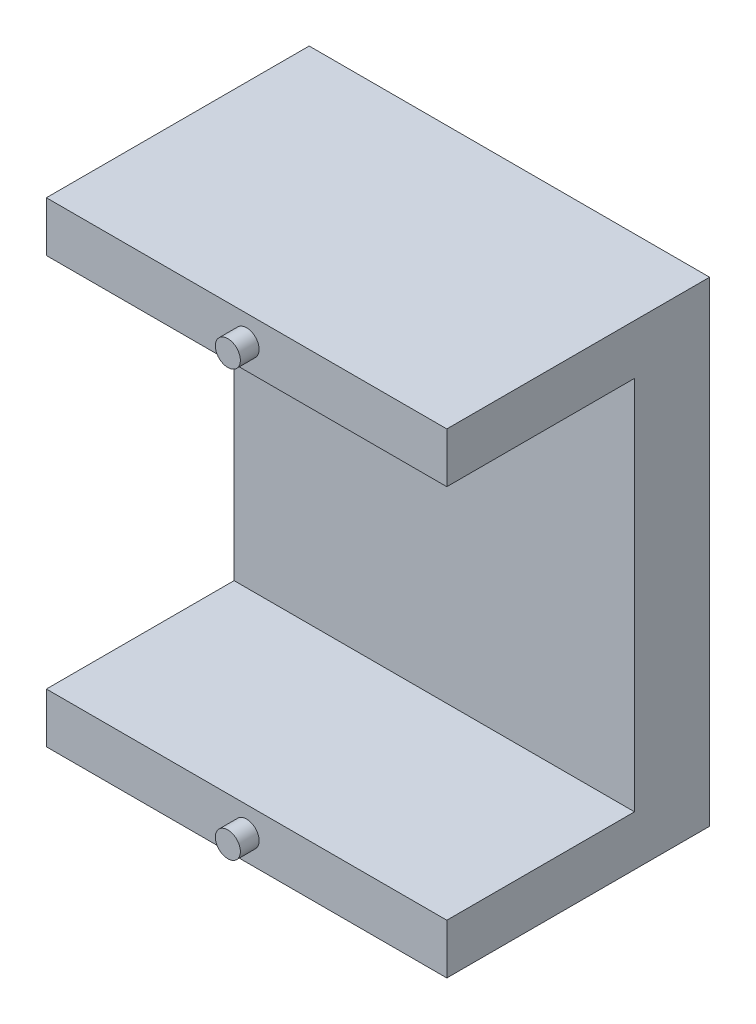
ISO-10303-21;
HEADER;
FILE_DESCRIPTION(('STEP AP214'),'2;1');
FILE_NAME('part.step','',(''),(''),'','','');
FILE_SCHEMA(('AUTOMOTIVE_DESIGN { 1 0 10303 214 1 1 1 1 }'));
ENDSEC;
DATA;
#1=APPLICATION_CONTEXT('core data for automotive mechanical design processes');
#2=APPLICATION_PROTOCOL_DEFINITION('international standard','automotive_design',2000,#1);
#3=PRODUCT_CONTEXT('',#1,'mechanical');
#4=PRODUCT('Part','Part','',(#3));
#5=PRODUCT_RELATED_PRODUCT_CATEGORY('part','',(#4));
#6=PRODUCT_DEFINITION_FORMATION('','',#4);
#7=PRODUCT_DEFINITION_CONTEXT('part definition',#1,'design');
#8=PRODUCT_DEFINITION('design','',#6,#7);
#9=PRODUCT_DEFINITION_SHAPE('','',#8);
#10=(LENGTH_UNIT() NAMED_UNIT(*) SI_UNIT(.MILLI.,.METRE.));
#11=(NAMED_UNIT(*) PLANE_ANGLE_UNIT() SI_UNIT($,.RADIAN.));
#12=(NAMED_UNIT(*) SI_UNIT($,.STERADIAN.) SOLID_ANGLE_UNIT());
#13=UNCERTAINTY_MEASURE_WITH_UNIT(LENGTH_MEASURE(1.E-05),#10,'distance_accuracy_value','');
#14=(GEOMETRIC_REPRESENTATION_CONTEXT(3) GLOBAL_UNCERTAINTY_ASSIGNED_CONTEXT((#13)) GLOBAL_UNIT_ASSIGNED_CONTEXT((#10,
#11,#12)) REPRESENTATION_CONTEXT('',''));
#15=CARTESIAN_POINT('',(0.,0.,0.));
#16=DIRECTION('',(0.,0.,1.));
#17=DIRECTION('',(1.,0.,0.));
#18=AXIS2_PLACEMENT_3D('',#15,#16,#17);
#19=CARTESIAN_POINT('',(16.,0.,0.));
#20=DIRECTION('',(0.,0.,1.));
#21=DIRECTION('',(1.,0.,0.));
#22=AXIS2_PLACEMENT_3D('',#19,#20,#21);
#23=PLANE('',#22);
#24=DIRECTION('',(0.,1.,0.));
#25=VECTOR('',#24,1.);
#26=CARTESIAN_POINT('',(-16.,0.,0.));
#27=LINE('',#26,#25);
#28=CARTESIAN_POINT('',(-16.,0.,0.));
#29=VERTEX_POINT('',#28);
#30=CARTESIAN_POINT('',(-16.,4.,0.));
#31=VERTEX_POINT('',#30);
#32=EDGE_CURVE('E151',#29,#31,#27,.T.);
#33=ORIENTED_EDGE('',*,*,#32,.F.);
#34=DIRECTION('',(-1.,0.,0.));
#35=VECTOR('',#34,1.);
#36=CARTESIAN_POINT('',(16.,0.,0.));
#37=LINE('',#36,#35);
#38=CARTESIAN_POINT('',(16.,0.,0.));
#39=VERTEX_POINT('',#38);
#40=EDGE_CURVE('E43',#39,#29,#37,.T.);
#41=ORIENTED_EDGE('',*,*,#40,.F.);
#42=DIRECTION('',(0.,1.,0.));
#43=VECTOR('',#42,1.);
#44=CARTESIAN_POINT('',(16.,0.,0.));
#45=LINE('',#44,#43);
#46=CARTESIAN_POINT('',(16.,4.,0.));
#47=VERTEX_POINT('',#46);
#48=EDGE_CURVE('E122',#39,#47,#45,.T.);
#49=ORIENTED_EDGE('',*,*,#48,.T.);
#50=DIRECTION('',(-1.,0.,0.));
#51=VECTOR('',#50,1.);
#52=CARTESIAN_POINT('',(16.,4.,0.));
#53=LINE('',#52,#51);
#54=EDGE_CURVE('E11',#47,#31,#53,.T.);
#55=ORIENTED_EDGE('',*,*,#54,.T.);
#56=EDGE_LOOP('',(#33,#41,#49,#55));
#57=FACE_BOUND('',#56,.T.);
#58=CARTESIAN_POINT('',(0.,2.,0.));
#59=DIRECTION('',(0.,0.,1.));
#60=DIRECTION('',(1.,0.,0.));
#61=AXIS2_PLACEMENT_3D('',#58,#59,#60);
#62=CIRCLE('',#61,1.);
#63=CARTESIAN_POINT('',(1.,2.,0.));
#64=VERTEX_POINT('',#63);
#65=EDGE_CURVE('E37',#64,#64,#62,.F.);
#66=ORIENTED_EDGE('',*,*,#65,.T.);
#67=EDGE_LOOP('',(#66));
#68=FACE_BOUND('',#67,.T.);
#69=ADVANCED_FACE('F33',(#57,#68),#23,.T.);
#70=CARTESIAN_POINT('',(16.,34.,0.));
#71=DIRECTION('',(0.,0.,1.));
#72=DIRECTION('',(1.,0.,0.));
#73=AXIS2_PLACEMENT_3D('',#70,#71,#72);
#74=PLANE('',#73);
#75=DIRECTION('',(0.,1.,0.));
#76=VECTOR('',#75,1.);
#77=CARTESIAN_POINT('',(-16.,34.,0.));
#78=LINE('',#77,#76);
#79=CARTESIAN_POINT('',(-16.,34.,0.));
#80=VERTEX_POINT('',#79);
#81=CARTESIAN_POINT('',(-16.,38.,0.));
#82=VERTEX_POINT('',#81);
#83=EDGE_CURVE('E142',#80,#82,#78,.T.);
#84=ORIENTED_EDGE('',*,*,#83,.F.);
#85=DIRECTION('',(-1.,0.,0.));
#86=VECTOR('',#85,1.);
#87=CARTESIAN_POINT('',(16.,34.,0.));
#88=LINE('',#87,#86);
#89=CARTESIAN_POINT('',(16.,34.,0.));
#90=VERTEX_POINT('',#89);
#91=EDGE_CURVE('E159',#90,#80,#88,.T.);
#92=ORIENTED_EDGE('',*,*,#91,.F.);
#93=DIRECTION('',(0.,1.,0.));
#94=VECTOR('',#93,1.);
#95=CARTESIAN_POINT('',(16.,34.,0.));
#96=LINE('',#95,#94);
#97=CARTESIAN_POINT('',(16.,38.,0.));
#98=VERTEX_POINT('',#97);
#99=EDGE_CURVE('E127',#90,#98,#96,.T.);
#100=ORIENTED_EDGE('',*,*,#99,.T.);
#101=DIRECTION('',(-1.,0.,0.));
#102=VECTOR('',#101,1.);
#103=CARTESIAN_POINT('',(16.,38.,0.));
#104=LINE('',#103,#102);
#105=EDGE_CURVE('E157',#98,#82,#104,.T.);
#106=ORIENTED_EDGE('',*,*,#105,.T.);
#107=EDGE_LOOP('',(#84,#92,#100,#106));
#108=FACE_BOUND('',#107,.T.);
#109=CARTESIAN_POINT('',(0.,36.,0.));
#110=DIRECTION('',(0.,0.,1.));
#111=DIRECTION('',(1.,0.,0.));
#112=AXIS2_PLACEMENT_3D('',#109,#110,#111);
#113=CIRCLE('',#112,1.);
#114=CARTESIAN_POINT('',(1.,36.,0.));
#115=VERTEX_POINT('',#114);
#116=EDGE_CURVE('E136',#115,#115,#113,.F.);
#117=ORIENTED_EDGE('',*,*,#116,.T.);
#118=EDGE_LOOP('',(#117));
#119=FACE_BOUND('',#118,.T.);
#120=ADVANCED_FACE('F184',(#108,#119),#74,.T.);
#121=CARTESIAN_POINT('',(16.,4.,0.));
#122=DIRECTION('',(0.,1.,0.));
#123=DIRECTION('',(0.,0.,1.));
#124=AXIS2_PLACEMENT_3D('',#121,#122,#123);
#125=PLANE('',#124);
#126=DIRECTION('',(0.,0.,-1.));
#127=VECTOR('',#126,1.);
#128=CARTESIAN_POINT('',(-16.,4.,0.));
#129=LINE('',#128,#127);
#130=CARTESIAN_POINT('',(-16.,4.,-15.));
#131=VERTEX_POINT('',#130);
#132=EDGE_CURVE('E132',#31,#131,#129,.T.);
#133=ORIENTED_EDGE('',*,*,#132,.F.);
#134=ORIENTED_EDGE('',*,*,#54,.F.);
#135=DIRECTION('',(0.,0.,-1.));
#136=VECTOR('',#135,1.);
#137=CARTESIAN_POINT('',(16.,4.,0.));
#138=LINE('',#137,#136);
#139=CARTESIAN_POINT('',(16.,4.,-15.));
#140=VERTEX_POINT('',#139);
#141=EDGE_CURVE('E153',#47,#140,#138,.T.);
#142=ORIENTED_EDGE('',*,*,#141,.T.);
#143=DIRECTION('',(-1.,0.,0.));
#144=VECTOR('',#143,1.);
#145=CARTESIAN_POINT('',(16.,4.,-15.));
#146=LINE('',#145,#144);
#147=EDGE_CURVE('E90',#140,#131,#146,.T.);
#148=ORIENTED_EDGE('',*,*,#147,.T.);
#149=EDGE_LOOP('',(#133,#134,#142,#148));
#150=FACE_BOUND('',#149,.T.);
#151=ADVANCED_FACE('F35',(#150),#125,.T.);
#152=CARTESIAN_POINT('',(16.,0.,-21.));
#153=DIRECTION('',(0.,-1.,0.));
#154=DIRECTION('',(0.,0.,-1.));
#155=AXIS2_PLACEMENT_3D('',#152,#153,#154);
#156=PLANE('',#155);
#157=DIRECTION('',(0.,0.,1.));
#158=VECTOR('',#157,1.);
#159=CARTESIAN_POINT('',(-16.,0.,-21.));
#160=LINE('',#159,#158);
#161=CARTESIAN_POINT('',(-16.,0.,-21.));
#162=VERTEX_POINT('',#161);
#163=EDGE_CURVE('E109',#162,#29,#160,.T.);
#164=ORIENTED_EDGE('',*,*,#163,.F.);
#165=DIRECTION('',(-1.,0.,0.));
#166=VECTOR('',#165,1.);
#167=CARTESIAN_POINT('',(16.,0.,-21.));
#168=LINE('',#167,#166);
#169=CARTESIAN_POINT('',(16.,0.,-21.));
#170=VERTEX_POINT('',#169);
#171=EDGE_CURVE('E104',#170,#162,#168,.T.);
#172=ORIENTED_EDGE('',*,*,#171,.F.);
#173=DIRECTION('',(0.,0.,1.));
#174=VECTOR('',#173,1.);
#175=CARTESIAN_POINT('',(16.,0.,-21.));
#176=LINE('',#175,#174);
#177=EDGE_CURVE('E107',#170,#39,#176,.T.);
#178=ORIENTED_EDGE('',*,*,#177,.T.);
#179=ORIENTED_EDGE('',*,*,#40,.T.);
#180=EDGE_LOOP('',(#164,#172,#178,#179));
#181=FACE_BOUND('',#180,.T.);
#182=ADVANCED_FACE('F106',(#181),#156,.T.);
#183=CARTESIAN_POINT('',(16.,38.,-21.));
#184=DIRECTION('',(0.,0.,-1.));
#185=DIRECTION('',(0.,1.,0.));
#186=AXIS2_PLACEMENT_3D('',#183,#184,#185);
#187=PLANE('',#186);
#188=DIRECTION('',(0.,-1.,0.));
#189=VECTOR('',#188,1.);
#190=CARTESIAN_POINT('',(-16.,38.,-21.));
#191=LINE('',#190,#189);
#192=CARTESIAN_POINT('',(-16.,38.,-21.));
#193=VERTEX_POINT('',#192);
#194=EDGE_CURVE('E148',#193,#162,#191,.T.);
#195=ORIENTED_EDGE('',*,*,#194,.F.);
#196=DIRECTION('',(-1.,0.,0.));
#197=VECTOR('',#196,1.);
#198=CARTESIAN_POINT('',(16.,38.,-21.));
#199=LINE('',#198,#197);
#200=CARTESIAN_POINT('',(16.,38.,-21.));
#201=VERTEX_POINT('',#200);
#202=EDGE_CURVE('E114',#201,#193,#199,.T.);
#203=ORIENTED_EDGE('',*,*,#202,.F.);
#204=DIRECTION('',(0.,-1.,0.));
#205=VECTOR('',#204,1.);
#206=CARTESIAN_POINT('',(16.,38.,-21.));
#207=LINE('',#206,#205);
#208=EDGE_CURVE('E120',#201,#170,#207,.T.);
#209=ORIENTED_EDGE('',*,*,#208,.T.);
#210=ORIENTED_EDGE('',*,*,#171,.T.);
#211=EDGE_LOOP('',(#195,#203,#209,#210));
#212=FACE_BOUND('',#211,.T.);
#213=ADVANCED_FACE('F124',(#212),#187,.T.);
#214=CARTESIAN_POINT('',(16.,38.,0.));
#215=DIRECTION('',(0.,1.,0.));
#216=DIRECTION('',(0.,0.,1.));
#217=AXIS2_PLACEMENT_3D('',#214,#215,#216);
#218=PLANE('',#217);
#219=DIRECTION('',(0.,0.,-1.));
#220=VECTOR('',#219,1.);
#221=CARTESIAN_POINT('',(-16.,38.,0.));
#222=LINE('',#221,#220);
#223=EDGE_CURVE('E145',#82,#193,#222,.T.);
#224=ORIENTED_EDGE('',*,*,#223,.F.);
#225=ORIENTED_EDGE('',*,*,#105,.F.);
#226=DIRECTION('',(0.,0.,-1.));
#227=VECTOR('',#226,1.);
#228=CARTESIAN_POINT('',(16.,38.,0.));
#229=LINE('',#228,#227);
#230=EDGE_CURVE('E125',#98,#201,#229,.T.);
#231=ORIENTED_EDGE('',*,*,#230,.T.);
#232=ORIENTED_EDGE('',*,*,#202,.T.);
#233=EDGE_LOOP('',(#224,#225,#231,#232));
#234=FACE_BOUND('',#233,.T.);
#235=ADVANCED_FACE('F226',(#234),#218,.T.);
#236=CARTESIAN_POINT('',(16.,34.,-15.));
#237=DIRECTION('',(0.,-1.,0.));
#238=DIRECTION('',(0.,0.,-1.));
#239=AXIS2_PLACEMENT_3D('',#236,#237,#238);
#240=PLANE('',#239);
#241=DIRECTION('',(0.,0.,1.));
#242=VECTOR('',#241,1.);
#243=CARTESIAN_POINT('',(-16.,34.,-15.));
#244=LINE('',#243,#242);
#245=CARTESIAN_POINT('',(-16.,34.,-15.));
#246=VERTEX_POINT('',#245);
#247=EDGE_CURVE('E139',#246,#80,#244,.T.);
#248=ORIENTED_EDGE('',*,*,#247,.F.);
#249=DIRECTION('',(-1.,0.,0.));
#250=VECTOR('',#249,1.);
#251=CARTESIAN_POINT('',(16.,34.,-15.));
#252=LINE('',#251,#250);
#253=CARTESIAN_POINT('',(16.,34.,-15.));
#254=VERTEX_POINT('',#253);
#255=EDGE_CURVE('E161',#254,#246,#252,.T.);
#256=ORIENTED_EDGE('',*,*,#255,.F.);
#257=DIRECTION('',(0.,0.,1.));
#258=VECTOR('',#257,1.);
#259=CARTESIAN_POINT('',(16.,34.,-15.));
#260=LINE('',#259,#258);
#261=EDGE_CURVE('E178',#254,#90,#260,.T.);
#262=ORIENTED_EDGE('',*,*,#261,.T.);
#263=ORIENTED_EDGE('',*,*,#91,.T.);
#264=EDGE_LOOP('',(#248,#256,#262,#263));
#265=FACE_BOUND('',#264,.T.);
#266=ADVANCED_FACE('F189',(#265),#240,.T.);
#267=CARTESIAN_POINT('',(16.,4.,-15.));
#268=DIRECTION('',(0.,0.,1.));
#269=DIRECTION('',(1.,0.,0.));
#270=AXIS2_PLACEMENT_3D('',#267,#268,#269);
#271=PLANE('',#270);
#272=DIRECTION('',(0.,1.,0.));
#273=VECTOR('',#272,1.);
#274=CARTESIAN_POINT('',(-16.,4.,-15.));
#275=LINE('',#274,#273);
#276=EDGE_CURVE('E135',#131,#246,#275,.T.);
#277=ORIENTED_EDGE('',*,*,#276,.F.);
#278=ORIENTED_EDGE('',*,*,#147,.F.);
#279=DIRECTION('',(0.,1.,0.));
#280=VECTOR('',#279,1.);
#281=CARTESIAN_POINT('',(16.,4.,-15.));
#282=LINE('',#281,#280);
#283=EDGE_CURVE('E176',#140,#254,#282,.T.);
#284=ORIENTED_EDGE('',*,*,#283,.T.);
#285=ORIENTED_EDGE('',*,*,#255,.T.);
#286=EDGE_LOOP('',(#277,#278,#284,#285));
#287=FACE_BOUND('',#286,.T.);
#288=ADVANCED_FACE('F190',(#287),#271,.T.);
#289=CARTESIAN_POINT('',(16.,0.,0.));
#290=DIRECTION('',(1.,0.,0.));
#291=DIRECTION('',(0.,0.,-1.));
#292=AXIS2_PLACEMENT_3D('',#289,#290,#291);
#293=PLANE('',#292);
#294=ORIENTED_EDGE('',*,*,#141,.F.);
#295=ORIENTED_EDGE('',*,*,#48,.F.);
#296=ORIENTED_EDGE('',*,*,#177,.F.);
#297=ORIENTED_EDGE('',*,*,#208,.F.);
#298=ORIENTED_EDGE('',*,*,#230,.F.);
#299=ORIENTED_EDGE('',*,*,#99,.F.);
#300=ORIENTED_EDGE('',*,*,#261,.F.);
#301=ORIENTED_EDGE('',*,*,#283,.F.);
#302=EDGE_LOOP('',(#294,#295,#296,#297,#298,#299,#300,#301));
#303=FACE_BOUND('',#302,.T.);
#304=ADVANCED_FACE('F118',(#303),#293,.T.);
#305=CARTESIAN_POINT('',(-16.,0.,0.));
#306=DIRECTION('',(1.,0.,0.));
#307=DIRECTION('',(0.,0.,-1.));
#308=AXIS2_PLACEMENT_3D('',#305,#306,#307);
#309=PLANE('',#308);
#310=ORIENTED_EDGE('',*,*,#132,.T.);
#311=ORIENTED_EDGE('',*,*,#276,.T.);
#312=ORIENTED_EDGE('',*,*,#247,.T.);
#313=ORIENTED_EDGE('',*,*,#83,.T.);
#314=ORIENTED_EDGE('',*,*,#223,.T.);
#315=ORIENTED_EDGE('',*,*,#194,.T.);
#316=ORIENTED_EDGE('',*,*,#163,.T.);
#317=ORIENTED_EDGE('',*,*,#32,.T.);
#318=EDGE_LOOP('',(#310,#311,#312,#313,#314,#315,#316,#317));
#319=FACE_BOUND('',#318,.T.);
#320=ADVANCED_FACE('F192',(#319),#309,.F.);
#321=CARTESIAN_POINT('',(0.,36.,1.5));
#322=DIRECTION('',(0.,0.,-1.));
#323=DIRECTION('',(-1.,0.,0.));
#324=AXIS2_PLACEMENT_3D('',#321,#322,#323);
#325=CYLINDRICAL_SURFACE('',#324,1.);
#326=ORIENTED_EDGE('',*,*,#116,.F.);
#327=EDGE_LOOP('',(#326));
#328=FACE_BOUND('',#327,.T.);
#329=CARTESIAN_POINT('',(0.,36.,1.5));
#330=DIRECTION('',(0.,0.,1.));
#331=DIRECTION('',(1.,0.,0.));
#332=AXIS2_PLACEMENT_3D('',#329,#330,#331);
#333=CIRCLE('',#332,1.);
#334=CARTESIAN_POINT('',(1.,36.,1.5));
#335=VERTEX_POINT('',#334);
#336=EDGE_CURVE('E164',#335,#335,#333,.T.);
#337=ORIENTED_EDGE('',*,*,#336,.F.);
#338=EDGE_LOOP('',(#337));
#339=FACE_BOUND('',#338,.T.);
#340=ADVANCED_FACE('F214',(#328,#339),#325,.T.);
#341=CARTESIAN_POINT('',(0.,36.,1.5));
#342=DIRECTION('',(0.,0.,1.));
#343=DIRECTION('',(1.,0.,0.));
#344=AXIS2_PLACEMENT_3D('',#341,#342,#343);
#345=PLANE('',#344);
#346=ORIENTED_EDGE('',*,*,#336,.T.);
#347=EDGE_LOOP('',(#346));
#348=FACE_BOUND('',#347,.T.);
#349=ADVANCED_FACE('F202',(#348),#345,.T.);
#350=CARTESIAN_POINT('',(0.,2.,1.5));
#351=DIRECTION('',(0.,0.,-1.));
#352=DIRECTION('',(-1.,0.,0.));
#353=AXIS2_PLACEMENT_3D('',#350,#351,#352);
#354=CYLINDRICAL_SURFACE('',#353,1.);
#355=ORIENTED_EDGE('',*,*,#65,.F.);
#356=EDGE_LOOP('',(#355));
#357=FACE_BOUND('',#356,.T.);
#358=CARTESIAN_POINT('',(0.,2.,1.5));
#359=DIRECTION('',(0.,0.,1.));
#360=DIRECTION('',(1.,0.,0.));
#361=AXIS2_PLACEMENT_3D('',#358,#359,#360);
#362=CIRCLE('',#361,1.);
#363=CARTESIAN_POINT('',(1.,2.,1.5));
#364=VERTEX_POINT('',#363);
#365=EDGE_CURVE('E172',#364,#364,#362,.T.);
#366=ORIENTED_EDGE('',*,*,#365,.F.);
#367=EDGE_LOOP('',(#366));
#368=FACE_BOUND('',#367,.T.);
#369=ADVANCED_FACE('F198',(#357,#368),#354,.T.);
#370=CARTESIAN_POINT('',(0.,2.,1.5));
#371=DIRECTION('',(0.,0.,1.));
#372=DIRECTION('',(1.,0.,0.));
#373=AXIS2_PLACEMENT_3D('',#370,#371,#372);
#374=PLANE('',#373);
#375=ORIENTED_EDGE('',*,*,#365,.T.);
#376=EDGE_LOOP('',(#375));
#377=FACE_BOUND('',#376,.T.);
#378=ADVANCED_FACE('F201',(#377),#374,.T.);
#379=CLOSED_SHELL('',(#69,#120,#151,#182,#213,#235,#266,#288,#304,#320,#340,#349,#369,#378));
#380=MANIFOLD_SOLID_BREP('B2',#379);
#381=ADVANCED_BREP_SHAPE_REPRESENTATION('',(#18,#380),#14);
#382=SHAPE_DEFINITION_REPRESENTATION(#9,#381);
ENDSEC;
END-ISO-10303-21;
